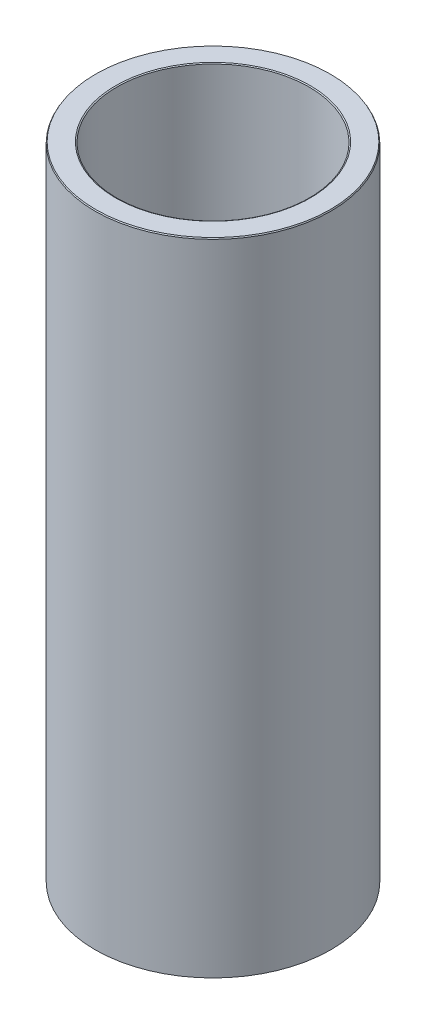
ISO-10303-21;
HEADER;
FILE_DESCRIPTION(('STEP AP214'),'2;1');
FILE_NAME('part.step','',(''),(''),'','','');
FILE_SCHEMA(('AUTOMOTIVE_DESIGN { 1 0 10303 214 1 1 1 1 }'));
ENDSEC;
DATA;
#1=APPLICATION_CONTEXT('core data for automotive mechanical design processes');
#2=APPLICATION_PROTOCOL_DEFINITION('international standard','automotive_design',2000,#1);
#3=PRODUCT_CONTEXT('',#1,'mechanical');
#4=PRODUCT('Part','Part','',(#3));
#5=PRODUCT_RELATED_PRODUCT_CATEGORY('part','',(#4));
#6=PRODUCT_DEFINITION_FORMATION('','',#4);
#7=PRODUCT_DEFINITION_CONTEXT('part definition',#1,'design');
#8=PRODUCT_DEFINITION('design','',#6,#7);
#9=PRODUCT_DEFINITION_SHAPE('','',#8);
#10=(LENGTH_UNIT() NAMED_UNIT(*) SI_UNIT(.MILLI.,.METRE.));
#11=(NAMED_UNIT(*) PLANE_ANGLE_UNIT() SI_UNIT($,.RADIAN.));
#12=(NAMED_UNIT(*) SI_UNIT($,.STERADIAN.) SOLID_ANGLE_UNIT());
#13=UNCERTAINTY_MEASURE_WITH_UNIT(LENGTH_MEASURE(1.E-05),#10,'distance_accuracy_value','');
#14=(GEOMETRIC_REPRESENTATION_CONTEXT(3) GLOBAL_UNCERTAINTY_ASSIGNED_CONTEXT((#13)) GLOBAL_UNIT_ASSIGNED_CONTEXT((#10,
#11,#12)) REPRESENTATION_CONTEXT('',''));
#15=CARTESIAN_POINT('',(0.,0.,0.));
#16=DIRECTION('',(0.,0.,1.));
#17=DIRECTION('',(1.,0.,0.));
#18=AXIS2_PLACEMENT_3D('',#15,#16,#17);
#19=CARTESIAN_POINT('',(0.,163.122701215678,0.));
#20=DIRECTION('',(0.,-1.,0.));
#21=DIRECTION('',(0.,0.,-1.));
#22=AXIS2_PLACEMENT_3D('',#19,#20,#21);
#23=CYLINDRICAL_SURFACE('',#22,30.);
#24=CARTESIAN_POINT('',(0.,0.165946830862296,0.));
#25=DIRECTION('',(0.,1.,0.));
#26=DIRECTION('',(0.,0.,1.));
#27=AXIS2_PLACEMENT_3D('',#24,#25,#26);
#28=CIRCLE('',#27,30.);
#29=CARTESIAN_POINT('',(0.,0.165946830862268,-30.));
#30=VERTEX_POINT('',#29);
#31=EDGE_CURVE('E10',#30,#30,#28,.T.);
#32=CARTESIAN_POINT('',(0.,162.835272873269,0.));
#33=DIRECTION('',(0.,1.,0.));
#34=DIRECTION('',(0.,0.,1.));
#35=AXIS2_PLACEMENT_3D('',#32,#33,#34);
#36=CIRCLE('',#35,30.);
#37=CARTESIAN_POINT('',(0.,162.835272873269,-30.));
#38=VERTEX_POINT('',#37);
#39=EDGE_CURVE('E50',#38,#38,#36,.F.);
#40=CARTESIAN_POINT('',(0.,0.165946830862268,-30.));
#41=CARTESIAN_POINT('',(0.,1.86041897713735,-30.));
#42=CARTESIAN_POINT('',(0.,3.55489112341242,-30.));
#43=CARTESIAN_POINT('',(0.,6.94383541596257,-30.));
#44=CARTESIAN_POINT('',(0.,8.63830756223764,-30.));
#45=CARTESIAN_POINT('',(0.,12.0272518547878,-30.));
#46=CARTESIAN_POINT('',(0.,13.7217240010629,-30.));
#47=CARTESIAN_POINT('',(0.,17.110668293613,-30.));
#48=CARTESIAN_POINT('',(0.,18.8051404398881,-30.));
#49=CARTESIAN_POINT('',(0.,22.1940847324382,-30.));
#50=CARTESIAN_POINT('',(0.,23.8885568787133,-30.));
#51=CARTESIAN_POINT('',(0.,27.2775011712634,-30.));
#52=CARTESIAN_POINT('',(0.,28.9719733175385,-30.));
#53=CARTESIAN_POINT('',(0.,32.3609176100887,-30.));
#54=CARTESIAN_POINT('',(0.,34.0553897563637,-30.));
#55=CARTESIAN_POINT('',(0.,37.4443340489139,-30.));
#56=CARTESIAN_POINT('',(0.,39.1388061951889,-30.));
#57=CARTESIAN_POINT('',(0.,42.5277504877391,-30.));
#58=CARTESIAN_POINT('',(0.,44.2222226340142,-30.));
#59=CARTESIAN_POINT('',(0.,47.6111669265643,-30.));
#60=CARTESIAN_POINT('',(0.,49.3056390728394,-30.));
#61=CARTESIAN_POINT('',(0.,52.6945833653895,-30.));
#62=CARTESIAN_POINT('',(0.,54.3890555116646,-30.));
#63=CARTESIAN_POINT('',(0.,57.7779998042148,-30.));
#64=CARTESIAN_POINT('',(0.,59.4724719504898,-30.));
#65=CARTESIAN_POINT('',(0.,62.86141624304,-30.));
#66=CARTESIAN_POINT('',(0.,64.555888389315,-30.));
#67=CARTESIAN_POINT('',(0.,67.9448326818652,-30.));
#68=CARTESIAN_POINT('',(0.,69.6393048281403,-30.));
#69=CARTESIAN_POINT('',(0.,73.0282491206904,-30.));
#70=CARTESIAN_POINT('',(0.,74.7227212669655,-30.));
#71=CARTESIAN_POINT('',(0.,78.1116655595156,-30.));
#72=CARTESIAN_POINT('',(0.,79.8061377057907,-30.));
#73=CARTESIAN_POINT('',(0.,83.1950819983409,-30.));
#74=CARTESIAN_POINT('',(0.,84.8895541446159,-30.));
#75=CARTESIAN_POINT('',(0.,88.2784984371661,-30.));
#76=CARTESIAN_POINT('',(0.,89.9729705834411,-30.));
#77=CARTESIAN_POINT('',(0.,93.3619148759913,-30.));
#78=CARTESIAN_POINT('',(0.,95.0563870222664,-30.));
#79=CARTESIAN_POINT('',(0.,98.4453313148165,-30.));
#80=CARTESIAN_POINT('',(0.,100.139803461092,-30.));
#81=CARTESIAN_POINT('',(0.,103.528747753642,-30.));
#82=CARTESIAN_POINT('',(0.,105.223219899917,-30.));
#83=CARTESIAN_POINT('',(0.,108.612164192467,-30.));
#84=CARTESIAN_POINT('',(0.,110.306636338742,-30.));
#85=CARTESIAN_POINT('',(0.,113.695580631292,-30.));
#86=CARTESIAN_POINT('',(0.,115.390052777567,-30.));
#87=CARTESIAN_POINT('',(0.,118.778997070117,-30.));
#88=CARTESIAN_POINT('',(0.,120.473469216392,-30.));
#89=CARTESIAN_POINT('',(0.,123.862413508943,-30.));
#90=CARTESIAN_POINT('',(0.,125.556885655218,-30.));
#91=CARTESIAN_POINT('',(0.,128.945829947768,-30.));
#92=CARTESIAN_POINT('',(0.,130.640302094043,-30.));
#93=CARTESIAN_POINT('',(0.,134.029246386593,-30.));
#94=CARTESIAN_POINT('',(0.,135.723718532868,-30.));
#95=CARTESIAN_POINT('',(0.,139.112662825418,-30.));
#96=CARTESIAN_POINT('',(0.,140.807134971693,-30.));
#97=CARTESIAN_POINT('',(0.,144.196079264243,-30.));
#98=CARTESIAN_POINT('',(0.,145.890551410519,-30.));
#99=CARTESIAN_POINT('',(0.,149.279495703069,-30.));
#100=CARTESIAN_POINT('',(0.,150.973967849344,-30.));
#101=CARTESIAN_POINT('',(0.,154.362912141894,-30.));
#102=CARTESIAN_POINT('',(0.,156.057384288169,-30.));
#103=CARTESIAN_POINT('',(0.,159.446328580719,-30.));
#104=CARTESIAN_POINT('',(0.,161.140800726994,-30.));
#105=CARTESIAN_POINT('',(0.,162.835272873269,-30.));
#106=B_SPLINE_CURVE_WITH_KNOTS('',3,(#40,#41,#42,#43,#44,#45,#46,#47,#48,#49,#50,#51,#52,#53,
#54,#55,#56,#57,#58,#59,#60,#61,#62,#63,#64,#65,#66,#67,#68,#69,#70,#71,#72,#73,#74,#75,#76,#77,
#78,#79,#80,#81,#82,#83,#84,#85,#86,#87,#88,#89,#90,#91,#92,#93,#94,#95,#96,#97,#98,#99,#100,
#101,#102,#103,#104,#105),.UNSPECIFIED.,.F.,.F.,(4,2,2,2,2,2,2,2,2,2,2,2,2,2,2,2,2,2,2,2,2,2,2,
2,2,2,2,2,2,2,2,2,4),(0.,5.08341643882523,10.1668328776504,15.2502493164757,20.3336657553009,
25.4170821941261,30.5004986329513,35.5839150717766,40.6673315106017,45.750747949427,
50.8341643882522,55.9175808270774,61.0009972659026,66.0844137047279,71.1678301435531,
76.2512465823783,81.3346630212035,86.4180794600287,91.5014958988539,96.5849123376792,
101.668328776504,106.75174521533,111.835161654155,116.91857809298,122.001994531805,
127.08541097063,132.168827409456,137.252243848281,142.335660287106,147.419076725931,
152.502493164757,157.585909603582,162.669326042407),.UNSPECIFIED.);
#107=EDGE_CURVE('BSEAM39',#30,#38,#106,.T.);
#108=ORIENTED_EDGE('',*,*,#31,.T.);
#109=ORIENTED_EDGE('',*,*,#39,.T.);
#110=ORIENTED_EDGE('',*,*,#107,.T.);
#111=ORIENTED_EDGE('',*,*,#107,.F.);
#112=EDGE_LOOP('',(#108,#110,#109,#111));
#113=FACE_BOUND('',#112,.T.);
#114=ADVANCED_FACE('F39',(#113),#23,.T.);
#115=CARTESIAN_POINT('',(0.,163.122701215678,0.));
#116=DIRECTION('',(0.,1.,0.));
#117=DIRECTION('',(0.,0.,1.));
#118=AXIS2_PLACEMENT_3D('',#115,#116,#117);
#119=PLANE('',#118);
#120=CARTESIAN_POINT('',(0.,163.122701215678,0.));
#121=DIRECTION('',(0.,1.,0.));
#122=DIRECTION('',(0.,0.,1.));
#123=AXIS2_PLACEMENT_3D('',#120,#121,#122);
#124=CIRCLE('',#123,24.7542070546468);
#125=CARTESIAN_POINT('',(0.,163.122701215678,24.7542070546468));
#126=VERTEX_POINT('',#125);
#127=EDGE_CURVE('E58',#126,#126,#124,.F.);
#128=ORIENTED_EDGE('',*,*,#127,.T.);
#129=EDGE_LOOP('',(#128));
#130=FACE_BOUND('',#129,.T.);
#131=CARTESIAN_POINT('',(0.,163.122701215678,0.));
#132=DIRECTION('',(0.,1.,0.));
#133=DIRECTION('',(0.,0.,1.));
#134=AXIS2_PLACEMENT_3D('',#131,#132,#133);
#135=CIRCLE('',#134,29.8340531691378);
#136=CARTESIAN_POINT('',(0.,163.122701215678,29.8340531691378));
#137=VERTEX_POINT('',#136);
#138=EDGE_CURVE('E61',#137,#137,#135,.T.);
#139=ORIENTED_EDGE('',*,*,#138,.T.);
#140=EDGE_LOOP('',(#139));
#141=FACE_BOUND('',#140,.T.);
#142=ADVANCED_FACE('F88',(#130,#141),#119,.T.);
#143=CARTESIAN_POINT('',(0.,0.,0.));
#144=DIRECTION('',(0.,1.,0.));
#145=DIRECTION('',(0.,0.,1.));
#146=AXIS2_PLACEMENT_3D('',#143,#144,#145);
#147=PLANE('',#146);
#148=CARTESIAN_POINT('',(0.,0.,0.));
#149=DIRECTION('',(0.,1.,0.));
#150=DIRECTION('',(0.,0.,1.));
#151=AXIS2_PLACEMENT_3D('',#148,#149,#150);
#152=CIRCLE('',#151,24.6327255431005);
#153=CARTESIAN_POINT('',(0.,0.,24.6327255431005));
#154=VERTEX_POINT('',#153);
#155=EDGE_CURVE('E51',#154,#154,#152,.T.);
#156=ORIENTED_EDGE('',*,*,#155,.T.);
#157=EDGE_LOOP('',(#156));
#158=FACE_BOUND('',#157,.T.);
#159=CARTESIAN_POINT('',(0.,0.,0.));
#160=DIRECTION('',(0.,1.,0.));
#161=DIRECTION('',(0.,0.,1.));
#162=AXIS2_PLACEMENT_3D('',#159,#160,#161);
#163=CIRCLE('',#162,29.7125716575914);
#164=CARTESIAN_POINT('',(0.,0.,29.7125716575914));
#165=VERTEX_POINT('',#164);
#166=EDGE_CURVE('E54',#165,#165,#163,.F.);
#167=ORIENTED_EDGE('',*,*,#166,.T.);
#168=EDGE_LOOP('',(#167));
#169=FACE_BOUND('',#168,.T.);
#170=ADVANCED_FACE('F83',(#158,#169),#147,.F.);
#171=CARTESIAN_POINT('',(0.,163.122701215678,0.));
#172=DIRECTION('',(0.,-1.,0.));
#173=DIRECTION('',(0.,0.,-1.));
#174=AXIS2_PLACEMENT_3D('',#171,#172,#173);
#175=CYLINDRICAL_SURFACE('',#174,24.4667787122383);
#176=CARTESIAN_POINT('',(0.,162.956754384815,0.));
#177=DIRECTION('',(0.,1.,0.));
#178=DIRECTION('',(0.,0.,1.));
#179=AXIS2_PLACEMENT_3D('',#176,#177,#178);
#180=CIRCLE('',#179,24.4667787122383);
#181=CARTESIAN_POINT('',(0.,162.956754384815,-24.4667787122383));
#182=VERTEX_POINT('',#181);
#183=EDGE_CURVE('E67',#182,#182,#180,.T.);
#184=CARTESIAN_POINT('',(0.,0.287428342408441,0.));
#185=DIRECTION('',(0.,1.,0.));
#186=DIRECTION('',(0.,0.,1.));
#187=AXIS2_PLACEMENT_3D('',#184,#185,#186);
#188=CIRCLE('',#187,24.4667787122383);
#189=CARTESIAN_POINT('',(0.,0.287428342408441,-24.4667787122383));
#190=VERTEX_POINT('',#189);
#191=EDGE_CURVE('E69',#190,#190,#188,.F.);
#192=CARTESIAN_POINT('',(0.,162.956754384815,-24.4667787122383));
#193=CARTESIAN_POINT('',(0.,161.26228223854,-24.4667787122383));
#194=CARTESIAN_POINT('',(0.,159.567810092265,-24.4667787122383));
#195=CARTESIAN_POINT('',(0.,156.178865799715,-24.4667787122383));
#196=CARTESIAN_POINT('',(0.,154.48439365344,-24.4667787122383));
#197=CARTESIAN_POINT('',(0.,151.09544936089,-24.4667787122383));
#198=CARTESIAN_POINT('',(0.,149.400977214615,-24.4667787122383));
#199=CARTESIAN_POINT('',(0.,146.012032922065,-24.4667787122383));
#200=CARTESIAN_POINT('',(0.,144.31756077579,-24.4667787122383));
#201=CARTESIAN_POINT('',(0.,140.928616483239,-24.4667787122383));
#202=CARTESIAN_POINT('',(0.,139.234144336964,-24.4667787122383));
#203=CARTESIAN_POINT('',(0.,135.845200044414,-24.4667787122383));
#204=CARTESIAN_POINT('',(0.,134.150727898139,-24.4667787122383));
#205=CARTESIAN_POINT('',(0.,130.761783605589,-24.4667787122383));
#206=CARTESIAN_POINT('',(0.,129.067311459314,-24.4667787122383));
#207=CARTESIAN_POINT('',(0.,125.678367166764,-24.4667787122383));
#208=CARTESIAN_POINT('',(0.,123.983895020489,-24.4667787122383));
#209=CARTESIAN_POINT('',(0.,120.594950727939,-24.4667787122383));
#210=CARTESIAN_POINT('',(0.,118.900478581664,-24.4667787122383));
#211=CARTESIAN_POINT('',(0.,115.511534289113,-24.4667787122383));
#212=CARTESIAN_POINT('',(0.,113.817062142838,-24.4667787122383));
#213=CARTESIAN_POINT('',(0.,110.428117850288,-24.4667787122383));
#214=CARTESIAN_POINT('',(0.,108.733645704013,-24.4667787122383));
#215=CARTESIAN_POINT('',(0.,105.344701411463,-24.4667787122383));
#216=CARTESIAN_POINT('',(0.,103.650229265188,-24.4667787122383));
#217=CARTESIAN_POINT('',(0.,100.261284972638,-24.4667787122383));
#218=CARTESIAN_POINT('',(0.,98.5668128263626,-24.4667787122383));
#219=CARTESIAN_POINT('',(0.,95.1778685338125,-24.4667787122383));
#220=CARTESIAN_POINT('',(0.,93.4833963875374,-24.4667787122383));
#221=CARTESIAN_POINT('',(0.,90.0944520949873,-24.4667787122383));
#222=CARTESIAN_POINT('',(0.,88.3999799487122,-24.4667787122383));
#223=CARTESIAN_POINT('',(0.,85.0110356561621,-24.4667787122383));
#224=CARTESIAN_POINT('',(0.,83.316563509887,-24.4667787122383));
#225=CARTESIAN_POINT('',(0.,79.9276192173369,-24.4667787122383));
#226=CARTESIAN_POINT('',(0.,78.2331470710618,-24.4667787122383));
#227=CARTESIAN_POINT('',(0.,74.8442027785116,-24.4667787122383));
#228=CARTESIAN_POINT('',(0.,73.1497306322366,-24.4667787122383));
#229=CARTESIAN_POINT('',(0.,69.7607863396864,-24.4667787122383));
#230=CARTESIAN_POINT('',(0.,68.0663141934113,-24.4667787122383));
#231=CARTESIAN_POINT('',(0.,64.6773699008612,-24.4667787122383));
#232=CARTESIAN_POINT('',(0.,62.9828977545861,-24.4667787122383));
#233=CARTESIAN_POINT('',(0.,59.593953462036,-24.4667787122383));
#234=CARTESIAN_POINT('',(0.,57.8994813157609,-24.4667787122383));
#235=CARTESIAN_POINT('',(0.,54.5105370232108,-24.4667787122383));
#236=CARTESIAN_POINT('',(0.,52.8160648769357,-24.4667787122383));
#237=CARTESIAN_POINT('',(0.,49.4271205843855,-24.4667787122383));
#238=CARTESIAN_POINT('',(0.,47.7326484381105,-24.4667787122383));
#239=CARTESIAN_POINT('',(0.,44.3437041455603,-24.4667787122383));
#240=CARTESIAN_POINT('',(0.,42.6492319992853,-24.4667787122383));
#241=CARTESIAN_POINT('',(0.,39.2602877067351,-24.4667787122383));
#242=CARTESIAN_POINT('',(0.,37.5658155604601,-24.4667787122383));
#243=CARTESIAN_POINT('',(0.,34.1768712679099,-24.4667787122383));
#244=CARTESIAN_POINT('',(0.,32.4823991216349,-24.4667787122383));
#245=CARTESIAN_POINT('',(0.,29.0934548290847,-24.4667787122383));
#246=CARTESIAN_POINT('',(0.,27.3989826828096,-24.4667787122383));
#247=CARTESIAN_POINT('',(0.,24.0100383902595,-24.4667787122383));
#248=CARTESIAN_POINT('',(0.,22.3155662439844,-24.4667787122383));
#249=CARTESIAN_POINT('',(0.,18.9266219514343,-24.4667787122383));
#250=CARTESIAN_POINT('',(0.,17.2321498051592,-24.4667787122383));
#251=CARTESIAN_POINT('',(0.,13.843205512609,-24.4667787122383));
#252=CARTESIAN_POINT('',(0.,12.148733366334,-24.4667787122383));
#253=CARTESIAN_POINT('',(0.,8.75978907378382,-24.4667787122383));
#254=CARTESIAN_POINT('',(0.,7.06531692750873,-24.4667787122383));
#255=CARTESIAN_POINT('',(0.,3.67637263495858,-24.4667787122383));
#256=CARTESIAN_POINT('',(0.,1.98190048868351,-24.4667787122383));
#257=CARTESIAN_POINT('',(0.,0.287428342408441,-24.4667787122383));
#258=B_SPLINE_CURVE_WITH_KNOTS('',3,(#192,#193,#194,#195,#196,#197,#198,#199,#200,#201,#202,
#203,#204,#205,#206,#207,#208,#209,#210,#211,#212,#213,#214,#215,#216,#217,#218,#219,#220,#221,
#222,#223,#224,#225,#226,#227,#228,#229,#230,#231,#232,#233,#234,#235,#236,#237,#238,#239,#240,
#241,#242,#243,#244,#245,#246,#247,#248,#249,#250,#251,#252,#253,#254,#255,#256,#257),
.UNSPECIFIED.,.F.,.F.,(4,2,2,2,2,2,2,2,2,2,2,2,2,2,2,2,2,2,2,2,2,2,2,2,2,2,2,2,2,2,2,2,4),(0.,
5.08341643882523,10.1668328776504,15.2502493164757,20.3336657553009,25.4170821941261,
30.5004986329513,35.5839150717765,40.6673315106018,45.750747949427,50.8341643882522,
55.9175808270774,61.0009972659026,66.0844137047278,71.167830143553,76.2512465823783,
81.3346630212035,86.4180794600287,91.5014958988539,96.5849123376791,101.668328776504,
106.75174521533,111.835161654155,116.91857809298,122.001994531805,127.08541097063,
132.168827409456,137.252243848281,142.335660287106,147.419076725931,152.502493164757,
157.585909603582,162.669326042407),.UNSPECIFIED.);
#259=EDGE_CURVE('BSEAM71',#182,#190,#258,.T.);
#260=ORIENTED_EDGE('',*,*,#183,.T.);
#261=ORIENTED_EDGE('',*,*,#191,.T.);
#262=ORIENTED_EDGE('',*,*,#259,.T.);
#263=ORIENTED_EDGE('',*,*,#259,.F.);
#264=EDGE_LOOP('',(#260,#262,#261,#263));
#265=FACE_BOUND('',#264,.T.);
#266=ADVANCED_FACE('F71',(#265),#175,.F.);
#267=CARTESIAN_POINT('',(0.,162.956754384815,0.));
#268=DIRECTION('',(0.,1.,0.));
#269=DIRECTION('',(0.,0.,1.));
#270=AXIS2_PLACEMENT_3D('',#267,#268,#269);
#271=CONICAL_SURFACE('',#270,24.4667787122383,1.04719755119661);
#272=ORIENTED_EDGE('',*,*,#127,.F.);
#273=EDGE_LOOP('',(#272));
#274=FACE_BOUND('',#273,.T.);
#275=ORIENTED_EDGE('',*,*,#183,.F.);
#276=EDGE_LOOP('',(#275));
#277=FACE_BOUND('',#276,.T.);
#278=ADVANCED_FACE('F77',(#274,#277),#271,.F.);
#279=CARTESIAN_POINT('',(0.,0.,0.));
#280=DIRECTION('',(0.,-1.,0.));
#281=DIRECTION('',(0.,0.,-1.));
#282=AXIS2_PLACEMENT_3D('',#279,#280,#281);
#283=CONICAL_SURFACE('',#282,24.6327255431005,0.523598775598305);
#284=ORIENTED_EDGE('',*,*,#191,.F.);
#285=EDGE_LOOP('',(#284));
#286=FACE_BOUND('',#285,.T.);
#287=ORIENTED_EDGE('',*,*,#155,.F.);
#288=EDGE_LOOP('',(#287));
#289=FACE_BOUND('',#288,.T.);
#290=ADVANCED_FACE('F73',(#286,#289),#283,.F.);
#291=CARTESIAN_POINT('',(0.,0.165946830862296,0.));
#292=DIRECTION('',(0.,1.,0.));
#293=DIRECTION('',(0.,0.,1.));
#294=AXIS2_PLACEMENT_3D('',#291,#292,#293);
#295=CONICAL_SURFACE('',#294,30.,1.04719755119663);
#296=ORIENTED_EDGE('',*,*,#166,.F.);
#297=EDGE_LOOP('',(#296));
#298=FACE_BOUND('',#297,.T.);
#299=ORIENTED_EDGE('',*,*,#31,.F.);
#300=EDGE_LOOP('',(#299));
#301=FACE_BOUND('',#300,.T.);
#302=ADVANCED_FACE('F76',(#298,#301),#295,.T.);
#303=CARTESIAN_POINT('',(0.,163.122701215678,0.));
#304=DIRECTION('',(0.,-1.,0.));
#305=DIRECTION('',(0.,0.,-1.));
#306=AXIS2_PLACEMENT_3D('',#303,#304,#305);
#307=CONICAL_SURFACE('',#306,29.8340531691378,0.523598775598285);
#308=ORIENTED_EDGE('',*,*,#39,.F.);
#309=EDGE_LOOP('',(#308));
#310=FACE_BOUND('',#309,.T.);
#311=ORIENTED_EDGE('',*,*,#138,.F.);
#312=EDGE_LOOP('',(#311));
#313=FACE_BOUND('',#312,.T.);
#314=ADVANCED_FACE('F45',(#310,#313),#307,.T.);
#315=CLOSED_SHELL('',(#114,#142,#170,#266,#278,#290,#302,#314));
#316=MANIFOLD_SOLID_BREP('B2',#315);
#317=ADVANCED_BREP_SHAPE_REPRESENTATION('',(#18,#316),#14);
#318=SHAPE_DEFINITION_REPRESENTATION(#9,#317);
ENDSEC;
END-ISO-10303-21;
